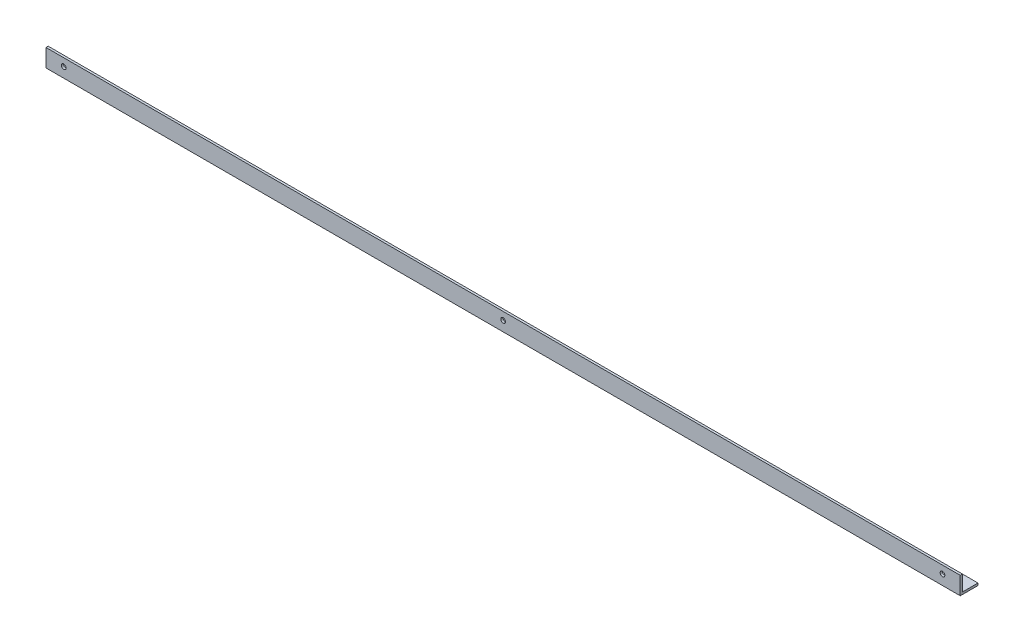
ISO-10303-21;
HEADER;
FILE_DESCRIPTION(('STEP AP214'),'2;1');
FILE_NAME('part.step','',(''),(''),'','','');
FILE_SCHEMA(('AUTOMOTIVE_DESIGN { 1 0 10303 214 1 1 1 1 }'));
ENDSEC;
DATA;
#1=APPLICATION_CONTEXT('core data for automotive mechanical design processes');
#2=APPLICATION_PROTOCOL_DEFINITION('international standard','automotive_design',2000,#1);
#3=PRODUCT_CONTEXT('',#1,'mechanical');
#4=PRODUCT('Part','Part','',(#3));
#5=PRODUCT_RELATED_PRODUCT_CATEGORY('part','',(#4));
#6=PRODUCT_DEFINITION_FORMATION('','',#4);
#7=PRODUCT_DEFINITION_CONTEXT('part definition',#1,'design');
#8=PRODUCT_DEFINITION('design','',#6,#7);
#9=PRODUCT_DEFINITION_SHAPE('','',#8);
#10=(LENGTH_UNIT() NAMED_UNIT(*) SI_UNIT(.MILLI.,.METRE.));
#11=(NAMED_UNIT(*) PLANE_ANGLE_UNIT() SI_UNIT($,.RADIAN.));
#12=(NAMED_UNIT(*) SI_UNIT($,.STERADIAN.) SOLID_ANGLE_UNIT());
#13=UNCERTAINTY_MEASURE_WITH_UNIT(LENGTH_MEASURE(1.E-05),#10,'distance_accuracy_value','');
#14=(GEOMETRIC_REPRESENTATION_CONTEXT(3) GLOBAL_UNCERTAINTY_ASSIGNED_CONTEXT((#13)) GLOBAL_UNIT_ASSIGNED_CONTEXT((#10,
#11,#12)) REPRESENTATION_CONTEXT('',''));
#15=CARTESIAN_POINT('',(0.,0.,0.));
#16=DIRECTION('',(0.,0.,1.));
#17=DIRECTION('',(1.,0.,0.));
#18=AXIS2_PLACEMENT_3D('',#15,#16,#17);
#19=CARTESIAN_POINT('',(-1307.86854000227,166.234228507342,2858.97175722218));
#20=DIRECTION('',(-1.,0.,0.));
#21=DIRECTION('',(0.,0.26471698178117,-0.964326147917118));
#22=AXIS2_PLACEMENT_3D('',#19,#20,#21);
#23=PLANE('',#22);
#24=DIRECTION('',(0.,-1.,0.));
#25=VECTOR('',#24,1.);
#26=CARTESIAN_POINT('',(-1307.86854000227,1.58750000000062,2820.87175722218));
#27=LINE('',#26,#25);
#28=CARTESIAN_POINT('',(-1307.86854000227,3.17500000000019,2820.87175722218));
#29=VERTEX_POINT('',#28);
#30=CARTESIAN_POINT('',(-1307.86854000227,0.,2820.87175722218));
#31=VERTEX_POINT('',#30);
#32=EDGE_CURVE('E203',#29,#31,#27,.T.);
#33=ORIENTED_EDGE('',*,*,#32,.T.);
#34=DIRECTION('',(0.,0.,1.));
#35=VECTOR('',#34,1.);
#36=CARTESIAN_POINT('',(-1307.86854000227,1.54219239510193E-13,2833.57175722218));
#37=LINE('',#36,#35);
#38=CARTESIAN_POINT('',(-1307.86854000227,-1.2884804952989E-12,2846.27175722218));
#39=VERTEX_POINT('',#38);
#40=EDGE_CURVE('E187',#31,#39,#37,.T.);
#41=ORIENTED_EDGE('',*,*,#40,.T.);
#42=DIRECTION('',(0.,1.,0.));
#43=VECTOR('',#42,1.);
#44=CARTESIAN_POINT('',(-1307.86854000227,12.6999999999988,2846.27175722218));
#45=LINE('',#44,#43);
#46=CARTESIAN_POINT('',(-1307.86854000227,25.4,2846.27175722218));
#47=VERTEX_POINT('',#46);
#48=EDGE_CURVE('E132',#39,#47,#45,.T.);
#49=ORIENTED_EDGE('',*,*,#48,.T.);
#50=DIRECTION('',(0.,0.,-1.));
#51=VECTOR('',#50,1.);
#52=CARTESIAN_POINT('',(-1307.86854000227,25.4000000000001,2844.68425722218));
#53=LINE('',#52,#51);
#54=CARTESIAN_POINT('',(-1307.86854000227,25.4000000000003,2843.09675722218));
#55=VERTEX_POINT('',#54);
#56=EDGE_CURVE('E117',#47,#55,#53,.T.);
#57=ORIENTED_EDGE('',*,*,#56,.T.);
#58=DIRECTION('',(0.,-1.,0.));
#59=VECTOR('',#58,1.);
#60=CARTESIAN_POINT('',(-1307.86854000227,14.2875000000003,2843.09675722218));
#61=LINE('',#60,#59);
#62=CARTESIAN_POINT('',(-1307.86854000227,3.17500000000025,2843.09675722218));
#63=VERTEX_POINT('',#62);
#64=EDGE_CURVE('E129',#55,#63,#61,.T.);
#65=ORIENTED_EDGE('',*,*,#64,.T.);
#66=DIRECTION('',(0.,0.,-1.));
#67=VECTOR('',#66,1.);
#68=CARTESIAN_POINT('',(-1307.86854000227,3.17500000000041,2831.98425722218));
#69=LINE('',#68,#67);
#70=EDGE_CURVE('E134',#63,#29,#69,.T.);
#71=ORIENTED_EDGE('',*,*,#70,.T.);
#72=EDGE_LOOP('',(#33,#41,#49,#57,#65,#71));
#73=FACE_BOUND('',#72,.T.);
#74=ADVANCED_FACE('F46',(#73),#23,.T.);
#75=CARTESIAN_POINT('',(-5072.16606568212,1.58750000000062,2820.87175722218));
#76=DIRECTION('',(0.,0.,1.));
#77=DIRECTION('',(0.,1.,0.));
#78=AXIS2_PLACEMENT_3D('',#75,#76,#77);
#79=PLANE('',#78);
#80=DIRECTION('',(1.,0.,0.));
#81=VECTOR('',#80,1.);
#82=CARTESIAN_POINT('',(-5072.16606568212,0.,2820.87175722218));
#83=LINE('',#82,#81);
#84=CARTESIAN_POINT('',(0.,0.,2820.87175722218));
#85=VERTEX_POINT('',#84);
#86=EDGE_CURVE('E151',#31,#85,#83,.T.);
#87=ORIENTED_EDGE('',*,*,#86,.F.);
#88=ORIENTED_EDGE('',*,*,#32,.F.);
#89=DIRECTION('',(1.,0.,0.));
#90=VECTOR('',#89,1.);
#91=CARTESIAN_POINT('',(-5072.16606568212,3.17500000000019,2820.87175722218));
#92=LINE('',#91,#90);
#93=CARTESIAN_POINT('',(0.,3.17500000000019,2820.87175722218));
#94=VERTEX_POINT('',#93);
#95=EDGE_CURVE('E148',#29,#94,#92,.T.);
#96=ORIENTED_EDGE('',*,*,#95,.T.);
#97=DIRECTION('',(0.,-1.,0.));
#98=VECTOR('',#97,1.);
#99=CARTESIAN_POINT('',(0.,1.58750000000062,2820.87175722218));
#100=LINE('',#99,#98);
#101=EDGE_CURVE('E186',#94,#85,#100,.T.);
#102=ORIENTED_EDGE('',*,*,#101,.T.);
#103=EDGE_LOOP('',(#87,#88,#96,#102));
#104=FACE_BOUND('',#103,.T.);
#105=ADVANCED_FACE('F212',(#104),#79,.F.);
#106=CARTESIAN_POINT('',(-5072.16606568212,1.54219239510193E-13,2833.57175722218));
#107=DIRECTION('',(0.,1.,0.));
#108=DIRECTION('',(0.,0.,-1.));
#109=AXIS2_PLACEMENT_3D('',#106,#107,#108);
#110=PLANE('',#109);
#111=DIRECTION('',(1.,0.,0.));
#112=VECTOR('',#111,1.);
#113=CARTESIAN_POINT('',(-5072.16606568212,-1.2884804952989E-12,2846.27175722218));
#114=LINE('',#113,#112);
#115=CARTESIAN_POINT('',(-1.77635683940025E-12,-1.2884804952989E-12,2846.27175722218));
#116=VERTEX_POINT('',#115);
#117=EDGE_CURVE('E155',#39,#116,#114,.T.);
#118=ORIENTED_EDGE('',*,*,#117,.F.);
#119=ORIENTED_EDGE('',*,*,#40,.F.);
#120=ORIENTED_EDGE('',*,*,#86,.T.);
#121=DIRECTION('',(0.,0.,1.));
#122=VECTOR('',#121,1.);
#123=CARTESIAN_POINT('',(0.,1.54219239510193E-13,2833.57175722218));
#124=LINE('',#123,#122);
#125=EDGE_CURVE('E191',#85,#116,#124,.T.);
#126=ORIENTED_EDGE('',*,*,#125,.T.);
#127=EDGE_LOOP('',(#118,#119,#120,#126));
#128=FACE_BOUND('',#127,.T.);
#129=ADVANCED_FACE('F216',(#128),#110,.F.);
#130=CARTESIAN_POINT('',(-5072.16606568212,12.6999999999988,2846.27175722218));
#131=DIRECTION('',(0.,0.,-1.));
#132=DIRECTION('',(0.,-1.,0.));
#133=AXIS2_PLACEMENT_3D('',#130,#131,#132);
#134=PLANE('',#133);
#135=CARTESIAN_POINT('',(-653.934270001134,14.2875000000003,2846.27175722218));
#136=DIRECTION('',(0.,0.,-1.));
#137=DIRECTION('',(0.,-1.,0.));
#138=AXIS2_PLACEMENT_3D('',#135,#136,#137);
#139=CIRCLE('',#138,3.37819999999983);
#140=CARTESIAN_POINT('',(-653.934270001134,10.9093000000005,2846.27175722218));
#141=VERTEX_POINT('',#140);
#142=EDGE_CURVE('E166',#141,#141,#139,.F.);
#143=ORIENTED_EDGE('',*,*,#142,.F.);
#144=EDGE_LOOP('',(#143));
#145=FACE_BOUND('',#144,.T.);
#146=CARTESIAN_POINT('',(-25.4000000000012,14.2875000000003,2846.27175722218));
#147=DIRECTION('',(0.,0.,-1.));
#148=DIRECTION('',(0.,-1.,0.));
#149=AXIS2_PLACEMENT_3D('',#146,#147,#148);
#150=CIRCLE('',#149,3.37819999999983);
#151=CARTESIAN_POINT('',(-25.4000000000012,10.9093000000005,2846.27175722218));
#152=VERTEX_POINT('',#151);
#153=EDGE_CURVE('E162',#152,#152,#150,.F.);
#154=ORIENTED_EDGE('',*,*,#153,.F.);
#155=EDGE_LOOP('',(#154));
#156=FACE_BOUND('',#155,.T.);
#157=CARTESIAN_POINT('',(-1282.46854000227,14.2874999999999,2846.27175722218));
#158=DIRECTION('',(0.,0.,-1.));
#159=DIRECTION('',(0.,-1.,0.));
#160=AXIS2_PLACEMENT_3D('',#157,#158,#159);
#161=CIRCLE('',#160,3.37820000000005);
#162=CARTESIAN_POINT('',(-1282.46854000227,10.9092999999999,2846.27175722218));
#163=VERTEX_POINT('',#162);
#164=EDGE_CURVE('E137',#163,#163,#161,.F.);
#165=ORIENTED_EDGE('',*,*,#164,.F.);
#166=EDGE_LOOP('',(#165));
#167=FACE_BOUND('',#166,.T.);
#168=DIRECTION('',(1.,0.,0.));
#169=VECTOR('',#168,1.);
#170=CARTESIAN_POINT('',(-5072.16606568212,25.4,2846.27175722218));
#171=LINE('',#170,#169);
#172=CARTESIAN_POINT('',(-1.77635683940025E-12,25.4,2846.27175722218));
#173=VERTEX_POINT('',#172);
#174=EDGE_CURVE('E122',#47,#173,#171,.T.);
#175=ORIENTED_EDGE('',*,*,#174,.F.);
#176=ORIENTED_EDGE('',*,*,#48,.F.);
#177=ORIENTED_EDGE('',*,*,#117,.T.);
#178=DIRECTION('',(0.,1.,0.));
#179=VECTOR('',#178,1.);
#180=CARTESIAN_POINT('',(-1.77635683940025E-12,12.6999999999988,2846.27175722218));
#181=LINE('',#180,#179);
#182=EDGE_CURVE('E195',#116,#173,#181,.T.);
#183=ORIENTED_EDGE('',*,*,#182,.T.);
#184=EDGE_LOOP('',(#175,#176,#177,#183));
#185=FACE_BOUND('',#184,.T.);
#186=ADVANCED_FACE('F218',(#145,#156,#167,#185),#134,.F.);
#187=CARTESIAN_POINT('',(-5072.16606568212,3.17500000000042,2831.98425722218));
#188=DIRECTION('',(0.,-1.,0.));
#189=DIRECTION('',(0.,0.,1.));
#190=AXIS2_PLACEMENT_3D('',#187,#188,#189);
#191=PLANE('',#190);
#192=ORIENTED_EDGE('',*,*,#95,.F.);
#193=ORIENTED_EDGE('',*,*,#70,.F.);
#194=DIRECTION('',(1.,0.,0.));
#195=VECTOR('',#194,1.);
#196=CARTESIAN_POINT('',(-5072.16606568212,3.17500000000025,2843.09675722218));
#197=LINE('',#196,#195);
#198=CARTESIAN_POINT('',(0.,3.17500000000025,2843.09675722218));
#199=VERTEX_POINT('',#198);
#200=EDGE_CURVE('E11',#63,#199,#197,.T.);
#201=ORIENTED_EDGE('',*,*,#200,.T.);
#202=DIRECTION('',(0.,0.,-1.));
#203=VECTOR('',#202,1.);
#204=CARTESIAN_POINT('',(-1.77635683940025E-12,3.17500000000042,2831.98425722218));
#205=LINE('',#204,#203);
#206=EDGE_CURVE('E184',#199,#94,#205,.T.);
#207=ORIENTED_EDGE('',*,*,#206,.T.);
#208=EDGE_LOOP('',(#192,#193,#201,#207));
#209=FACE_BOUND('',#208,.T.);
#210=ADVANCED_FACE('F209',(#209),#191,.F.);
#211=CARTESIAN_POINT('',(-5072.16606568213,25.4000000000001,2844.68425722218));
#212=DIRECTION('',(0.,-1.,0.));
#213=DIRECTION('',(0.,0.,1.));
#214=AXIS2_PLACEMENT_3D('',#211,#212,#213);
#215=PLANE('',#214);
#216=DIRECTION('',(1.,0.,0.));
#217=VECTOR('',#216,1.);
#218=CARTESIAN_POINT('',(-5072.16606568212,25.4000000000003,2843.09675722218));
#219=LINE('',#218,#217);
#220=CARTESIAN_POINT('',(0.,25.4000000000003,2843.09675722218));
#221=VERTEX_POINT('',#220);
#222=EDGE_CURVE('E56',#55,#221,#219,.T.);
#223=ORIENTED_EDGE('',*,*,#222,.F.);
#224=ORIENTED_EDGE('',*,*,#56,.F.);
#225=ORIENTED_EDGE('',*,*,#174,.T.);
#226=DIRECTION('',(0.,0.,-1.));
#227=VECTOR('',#226,1.);
#228=CARTESIAN_POINT('',(0.,25.4000000000001,2844.68425722218));
#229=LINE('',#228,#227);
#230=EDGE_CURVE('E119',#173,#221,#229,.T.);
#231=ORIENTED_EDGE('',*,*,#230,.T.);
#232=EDGE_LOOP('',(#223,#224,#225,#231));
#233=FACE_BOUND('',#232,.T.);
#234=ADVANCED_FACE('F116',(#233),#215,.F.);
#235=CARTESIAN_POINT('',(-5072.16606568212,14.2875000000003,2843.09675722218));
#236=DIRECTION('',(0.,0.,1.));
#237=DIRECTION('',(0.,1.,0.));
#238=AXIS2_PLACEMENT_3D('',#235,#236,#237);
#239=PLANE('',#238);
#240=CARTESIAN_POINT('',(-653.934270001134,14.2875000000008,2843.09675722218));
#241=DIRECTION('',(0.,0.,1.));
#242=DIRECTION('',(0.,1.,0.));
#243=AXIS2_PLACEMENT_3D('',#240,#241,#242);
#244=CIRCLE('',#243,3.37819999999983);
#245=CARTESIAN_POINT('',(-653.934270001134,17.6657000000006,2843.09675722218));
#246=VERTEX_POINT('',#245);
#247=EDGE_CURVE('E50',#246,#246,#244,.F.);
#248=ORIENTED_EDGE('',*,*,#247,.F.);
#249=EDGE_LOOP('',(#248));
#250=FACE_BOUND('',#249,.T.);
#251=CARTESIAN_POINT('',(-25.3999999999994,14.2875000000008,2843.09675722218));
#252=DIRECTION('',(0.,0.,1.));
#253=DIRECTION('',(0.,1.,0.));
#254=AXIS2_PLACEMENT_3D('',#251,#252,#253);
#255=CIRCLE('',#254,3.37819999999983);
#256=CARTESIAN_POINT('',(-25.3999999999994,17.6657000000006,2843.09675722218));
#257=VERTEX_POINT('',#256);
#258=EDGE_CURVE('E163',#257,#257,#255,.F.);
#259=ORIENTED_EDGE('',*,*,#258,.F.);
#260=EDGE_LOOP('',(#259));
#261=FACE_BOUND('',#260,.T.);
#262=CARTESIAN_POINT('',(-1282.46854000227,14.2875000000003,2843.09675722218));
#263=DIRECTION('',(0.,0.,1.));
#264=DIRECTION('',(0.,1.,0.));
#265=AXIS2_PLACEMENT_3D('',#262,#263,#264);
#266=CIRCLE('',#265,3.37820000000005);
#267=CARTESIAN_POINT('',(-1282.46854000227,17.6657000000004,2843.09675722218));
#268=VERTEX_POINT('',#267);
#269=EDGE_CURVE('E144',#268,#268,#266,.F.);
#270=ORIENTED_EDGE('',*,*,#269,.F.);
#271=EDGE_LOOP('',(#270));
#272=FACE_BOUND('',#271,.T.);
#273=ORIENTED_EDGE('',*,*,#200,.F.);
#274=ORIENTED_EDGE('',*,*,#64,.F.);
#275=ORIENTED_EDGE('',*,*,#222,.T.);
#276=DIRECTION('',(0.,-1.,0.));
#277=VECTOR('',#276,1.);
#278=CARTESIAN_POINT('',(0.,14.2875000000003,2843.09675722218));
#279=LINE('',#278,#277);
#280=EDGE_CURVE('E152',#221,#199,#279,.T.);
#281=ORIENTED_EDGE('',*,*,#280,.T.);
#282=EDGE_LOOP('',(#273,#274,#275,#281));
#283=FACE_BOUND('',#282,.T.);
#284=ADVANCED_FACE('F48',(#250,#261,#272,#283),#239,.F.);
#285=CARTESIAN_POINT('',(0.,166.234228507342,2858.97175722218));
#286=DIRECTION('',(-1.,0.,0.));
#287=DIRECTION('',(0.,0.26471698178117,-0.964326147917118));
#288=AXIS2_PLACEMENT_3D('',#285,#286,#287);
#289=PLANE('',#288);
#290=ORIENTED_EDGE('',*,*,#280,.F.);
#291=ORIENTED_EDGE('',*,*,#230,.F.);
#292=ORIENTED_EDGE('',*,*,#182,.F.);
#293=ORIENTED_EDGE('',*,*,#125,.F.);
#294=ORIENTED_EDGE('',*,*,#101,.F.);
#295=ORIENTED_EDGE('',*,*,#206,.F.);
#296=EDGE_LOOP('',(#290,#291,#292,#293,#294,#295));
#297=FACE_BOUND('',#296,.T.);
#298=ADVANCED_FACE('F221',(#297),#289,.F.);
#299=CARTESIAN_POINT('',(-1282.46854000227,14.2875000000028,-706.945233404852));
#300=DIRECTION('',(0.,0.,1.));
#301=DIRECTION('',(0.,1.,0.));
#302=AXIS2_PLACEMENT_3D('',#299,#300,#301);
#303=CYLINDRICAL_SURFACE('',#302,3.37820000000005);
#304=ORIENTED_EDGE('',*,*,#269,.T.);
#305=EDGE_LOOP('',(#304));
#306=FACE_BOUND('',#305,.T.);
#307=ORIENTED_EDGE('',*,*,#164,.T.);
#308=EDGE_LOOP('',(#307));
#309=FACE_BOUND('',#308,.T.);
#310=ADVANCED_FACE('F223',(#306,#309),#303,.F.);
#311=CARTESIAN_POINT('',(-25.3999999999994,14.2875000000028,-706.945233404852));
#312=DIRECTION('',(0.,0.,1.));
#313=DIRECTION('',(0.,1.,0.));
#314=AXIS2_PLACEMENT_3D('',#311,#312,#313);
#315=CYLINDRICAL_SURFACE('',#314,3.37819999999983);
#316=ORIENTED_EDGE('',*,*,#258,.T.);
#317=EDGE_LOOP('',(#316));
#318=FACE_BOUND('',#317,.T.);
#319=ORIENTED_EDGE('',*,*,#153,.T.);
#320=EDGE_LOOP('',(#319));
#321=FACE_BOUND('',#320,.T.);
#322=ADVANCED_FACE('F229',(#318,#321),#315,.F.);
#323=CARTESIAN_POINT('',(-653.934270001134,14.2875000000028,-706.945233404851));
#324=DIRECTION('',(0.,0.,1.));
#325=DIRECTION('',(0.,1.,0.));
#326=AXIS2_PLACEMENT_3D('',#323,#324,#325);
#327=CYLINDRICAL_SURFACE('',#326,3.37819999999983);
#328=ORIENTED_EDGE('',*,*,#247,.T.);
#329=EDGE_LOOP('',(#328));
#330=FACE_BOUND('',#329,.T.);
#331=ORIENTED_EDGE('',*,*,#142,.T.);
#332=EDGE_LOOP('',(#331));
#333=FACE_BOUND('',#332,.T.);
#334=ADVANCED_FACE('F287',(#330,#333),#327,.F.);
#335=CLOSED_SHELL('',(#74,#105,#129,#186,#210,#234,#284,#298,#310,#322,#334));
#336=MANIFOLD_SOLID_BREP('B2',#335);
#337=ADVANCED_BREP_SHAPE_REPRESENTATION('',(#18,#336),#14);
#338=SHAPE_DEFINITION_REPRESENTATION(#9,#337);
ENDSEC;
END-ISO-10303-21;
